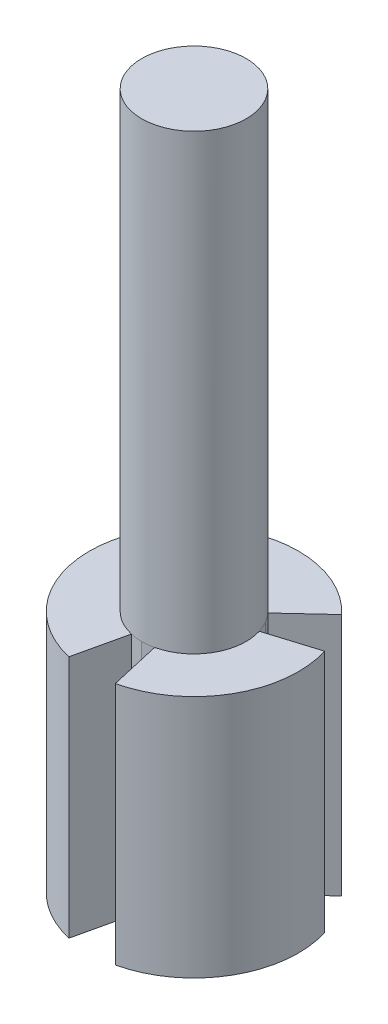
ISO-10303-21;
HEADER;
FILE_DESCRIPTION(('STEP AP214'),'2;1');
FILE_NAME('part.step','',(''),(''),'','','');
FILE_SCHEMA(('AUTOMOTIVE_DESIGN { 1 0 10303 214 1 1 1 1 }'));
ENDSEC;
DATA;
#1=APPLICATION_CONTEXT('core data for automotive mechanical design processes');
#2=APPLICATION_PROTOCOL_DEFINITION('international standard','automotive_design',2000,#1);
#3=PRODUCT_CONTEXT('',#1,'mechanical');
#4=PRODUCT('Part','Part','',(#3));
#5=PRODUCT_RELATED_PRODUCT_CATEGORY('part','',(#4));
#6=PRODUCT_DEFINITION_FORMATION('','',#4);
#7=PRODUCT_DEFINITION_CONTEXT('part definition',#1,'design');
#8=PRODUCT_DEFINITION('design','',#6,#7);
#9=PRODUCT_DEFINITION_SHAPE('','',#8);
#10=(LENGTH_UNIT() NAMED_UNIT(*) SI_UNIT(.MILLI.,.METRE.));
#11=(NAMED_UNIT(*) PLANE_ANGLE_UNIT() SI_UNIT($,.RADIAN.));
#12=(NAMED_UNIT(*) SI_UNIT($,.STERADIAN.) SOLID_ANGLE_UNIT());
#13=UNCERTAINTY_MEASURE_WITH_UNIT(LENGTH_MEASURE(1.E-05),#10,'distance_accuracy_value','');
#14=(GEOMETRIC_REPRESENTATION_CONTEXT(3) GLOBAL_UNCERTAINTY_ASSIGNED_CONTEXT((#13)) GLOBAL_UNIT_ASSIGNED_CONTEXT((#10,
#11,#12)) REPRESENTATION_CONTEXT('',''));
#15=CARTESIAN_POINT('',(0.,0.,0.));
#16=DIRECTION('',(0.,0.,1.));
#17=DIRECTION('',(1.,0.,0.));
#18=AXIS2_PLACEMENT_3D('',#15,#16,#17);
#19=CARTESIAN_POINT('',(0.,70.,0.));
#20=DIRECTION('',(0.,-1.,0.));
#21=DIRECTION('',(0.,0.,-1.));
#22=AXIS2_PLACEMENT_3D('',#19,#20,#21);
#23=CYLINDRICAL_SURFACE('',#22,30.);
#24=DIRECTION('',(0.,-1.,0.));
#25=VECTOR('',#24,1.);
#26=CARTESIAN_POINT('',(21.9974186413753,70.,-20.3988620544401));
#27=LINE('',#26,#25);
#28=CARTESIAN_POINT('',(21.9974186413753,0.,-20.3988620544401));
#29=VERTEX_POINT('',#28);
#30=CARTESIAN_POINT('',(21.9974186413753,70.,-20.3988620544401));
#31=VERTEX_POINT('',#30);
#32=EDGE_CURVE('E229',#29,#31,#27,.F.);
#33=ORIENTED_EDGE('',*,*,#32,.F.);
#34=CARTESIAN_POINT('',(0.,0.,0.));
#35=DIRECTION('',(0.,-1.,0.));
#36=DIRECTION('',(0.,0.,-1.));
#37=AXIS2_PLACEMENT_3D('',#34,#35,#36);
#38=CIRCLE('',#37,30.);
#39=CARTESIAN_POINT('',(-21.997418641375,0.,-20.3988620544404));
#40=VERTEX_POINT('',#39);
#41=EDGE_CURVE('E279',#40,#29,#38,.T.);
#42=ORIENTED_EDGE('',*,*,#41,.F.);
#43=DIRECTION('',(0.,-1.,0.));
#44=VECTOR('',#43,1.);
#45=CARTESIAN_POINT('',(-21.997418641375,70.,-20.3988620544404));
#46=LINE('',#45,#44);
#47=CARTESIAN_POINT('',(-21.997418641375,70.,-20.3988620544404));
#48=VERTEX_POINT('',#47);
#49=EDGE_CURVE('E58',#48,#40,#46,.T.);
#50=ORIENTED_EDGE('',*,*,#49,.F.);
#51=CARTESIAN_POINT('',(0.,70.,0.));
#52=DIRECTION('',(0.,-1.,0.));
#53=DIRECTION('',(0.,0.,-1.));
#54=AXIS2_PLACEMENT_3D('',#51,#52,#53);
#55=CIRCLE('',#54,30.);
#56=EDGE_CURVE('E276',#48,#31,#55,.T.);
#57=ORIENTED_EDGE('',*,*,#56,.T.);
#58=EDGE_LOOP('',(#33,#42,#50,#57));
#59=FACE_BOUND('',#58,.T.);
#60=ADVANCED_FACE('F35',(#59),#23,.T.);
#61=CARTESIAN_POINT('',(0.,70.,0.));
#62=DIRECTION('',(0.,-1.,0.));
#63=DIRECTION('',(0.,0.,-1.));
#64=AXIS2_PLACEMENT_3D('',#61,#62,#63);
#65=PLANE('',#64);
#66=CARTESIAN_POINT('',(0.,70.,0.));
#67=DIRECTION('',(0.,-1.,0.));
#68=DIRECTION('',(0.,0.,-1.));
#69=AXIS2_PLACEMENT_3D('',#66,#67,#68);
#70=CIRCLE('',#69,15.);
#71=CARTESIAN_POINT('',(-10.9987093206875,70.,-10.1994310272202));
#72=VERTEX_POINT('',#71);
#73=CARTESIAN_POINT('',(10.9987093206876,70.,-10.19943102722));
#74=VERTEX_POINT('',#73);
#75=EDGE_CURVE('E208',#72,#74,#70,.T.);
#76=ORIENTED_EDGE('',*,*,#75,.T.);
#77=DIRECTION('',(-0.733247288045842,0.,0.679962068481336));
#78=VECTOR('',#77,1.);
#79=CARTESIAN_POINT('',(10.9987093206876,70.,-10.19943102722));
#80=LINE('',#79,#78);
#81=EDGE_CURVE('E176',#31,#74,#80,.T.);
#82=ORIENTED_EDGE('',*,*,#81,.F.);
#83=ORIENTED_EDGE('',*,*,#56,.F.);
#84=DIRECTION('',(-0.733247288045833,0.,-0.679962068481347));
#85=VECTOR('',#84,1.);
#86=CARTESIAN_POINT('',(-10.9987093206875,70.,-10.1994310272202));
#87=LINE('',#86,#85);
#88=EDGE_CURVE('E234',#72,#48,#87,.T.);
#89=ORIENTED_EDGE('',*,*,#88,.F.);
#90=EDGE_LOOP('',(#76,#82,#83,#89));
#91=FACE_BOUND('',#90,.T.);
#92=ADVANCED_FACE('F308',(#91),#65,.F.);
#93=DIRECTION('',(0.,-1.,0.));
#94=VECTOR('',#93,1.);
#95=CARTESIAN_POINT('',(-28.6646420681272,70.,-8.85089233389217));
#96=LINE('',#95,#94);
#97=CARTESIAN_POINT('',(-28.6646420681272,0.,-8.85089233389217));
#98=VERTEX_POINT('',#97);
#99=CARTESIAN_POINT('',(-28.6646420681272,70.,-8.85089233389218));
#100=VERTEX_POINT('',#99);
#101=EDGE_CURVE('E249',#98,#100,#96,.F.);
#102=ORIENTED_EDGE('',*,*,#101,.F.);
#103=CARTESIAN_POINT('',(-6.66722342675217,0.,29.2497543883323));
#104=VERTEX_POINT('',#103);
#105=EDGE_CURVE('E277',#104,#98,#38,.T.);
#106=ORIENTED_EDGE('',*,*,#105,.F.);
#107=DIRECTION('',(0.,-1.,0.));
#108=VECTOR('',#107,1.);
#109=CARTESIAN_POINT('',(-6.66722342675217,70.,29.2497543883323));
#110=LINE('',#109,#108);
#111=CARTESIAN_POINT('',(-6.66722342675217,70.,29.2497543883323));
#112=VERTEX_POINT('',#111);
#113=EDGE_CURVE('E265',#112,#104,#110,.T.);
#114=ORIENTED_EDGE('',*,*,#113,.F.);
#115=EDGE_CURVE('E183',#112,#100,#55,.T.);
#116=ORIENTED_EDGE('',*,*,#115,.T.);
#117=EDGE_LOOP('',(#102,#106,#114,#116));
#118=FACE_BOUND('',#117,.T.);
#119=ADVANCED_FACE('F302',(#118),#23,.T.);
#120=CARTESIAN_POINT('',(-3.33361171337609,70.,14.6248771941662));
#121=VERTEX_POINT('',#120);
#122=CARTESIAN_POINT('',(-14.3323210340636,70.,-4.42544616694609));
#123=VERTEX_POINT('',#122);
#124=EDGE_CURVE('E193',#121,#123,#70,.T.);
#125=ORIENTED_EDGE('',*,*,#124,.T.);
#126=DIRECTION('',(0.955488068937574,0.,0.295029744463073));
#127=VECTOR('',#126,1.);
#128=CARTESIAN_POINT('',(-14.3323210340636,70.,-4.42544616694609));
#129=LINE('',#128,#127);
#130=EDGE_CURVE('E236',#100,#123,#129,.T.);
#131=ORIENTED_EDGE('',*,*,#130,.F.);
#132=ORIENTED_EDGE('',*,*,#115,.F.);
#133=DIRECTION('',(-0.222240780891739,0.,0.974991812944411));
#134=VECTOR('',#133,1.);
#135=CARTESIAN_POINT('',(-3.33361171337609,70.,14.6248771941662));
#136=LINE('',#135,#134);
#137=EDGE_CURVE('E254',#121,#112,#136,.T.);
#138=ORIENTED_EDGE('',*,*,#137,.F.);
#139=EDGE_LOOP('',(#125,#131,#132,#138));
#140=FACE_BOUND('',#139,.T.);
#141=ADVANCED_FACE('F309',(#140),#65,.F.);
#142=CARTESIAN_POINT('',(0.,200.,0.));
#143=DIRECTION('',(0.,-1.,0.));
#144=DIRECTION('',(0.,0.,-1.));
#145=AXIS2_PLACEMENT_3D('',#142,#143,#144);
#146=CYLINDRICAL_SURFACE('',#145,15.);
#147=CARTESIAN_POINT('',(0.,200.,0.));
#148=DIRECTION('',(0.,1.,0.));
#149=DIRECTION('',(0.,0.,1.));
#150=AXIS2_PLACEMENT_3D('',#147,#148,#149);
#151=CIRCLE('',#150,15.);
#152=CARTESIAN_POINT('',(0.,200.,15.));
#153=VERTEX_POINT('',#152);
#154=EDGE_CURVE('E181',#153,#153,#151,.T.);
#155=ORIENTED_EDGE('',*,*,#154,.F.);
#156=EDGE_LOOP('',(#155));
#157=FACE_BOUND('',#156,.T.);
#158=CARTESIAN_POINT('',(3.33361171337609,70.,14.6248771941662));
#159=VERTEX_POINT('',#158);
#160=CARTESIAN_POINT('',(0.,70.,15.));
#161=VERTEX_POINT('',#160);
#162=EDGE_CURVE('E180',#159,#161,#70,.T.);
#163=ORIENTED_EDGE('',*,*,#162,.F.);
#164=CARTESIAN_POINT('',(14.3323210340637,70.,-4.42544616694589));
#165=VERTEX_POINT('',#164);
#166=EDGE_CURVE('E152',#165,#159,#70,.T.);
#167=ORIENTED_EDGE('',*,*,#166,.F.);
#168=CARTESIAN_POINT('',(12.9903810567666,70.,-7.49999999999988));
#169=VERTEX_POINT('',#168);
#170=EDGE_CURVE('E142',#169,#165,#70,.T.);
#171=ORIENTED_EDGE('',*,*,#170,.F.);
#172=EDGE_CURVE('E151',#74,#169,#70,.T.);
#173=ORIENTED_EDGE('',*,*,#172,.F.);
#174=ORIENTED_EDGE('',*,*,#75,.F.);
#175=CARTESIAN_POINT('',(-12.9903810567665,70.,-7.50000000000006));
#176=VERTEX_POINT('',#175);
#177=EDGE_CURVE('E203',#176,#72,#70,.T.);
#178=ORIENTED_EDGE('',*,*,#177,.F.);
#179=EDGE_CURVE('E198',#123,#176,#70,.T.);
#180=ORIENTED_EDGE('',*,*,#179,.F.);
#181=ORIENTED_EDGE('',*,*,#124,.F.);
#182=EDGE_CURVE('E187',#161,#121,#70,.T.);
#183=ORIENTED_EDGE('',*,*,#182,.F.);
#184=EDGE_LOOP('',(#163,#167,#171,#173,#174,#178,#180,#181,#183));
#185=FACE_BOUND('',#184,.T.);
#186=ADVANCED_FACE('F37',(#157,#185),#146,.T.);
#187=CARTESIAN_POINT('',(0.,200.,0.));
#188=DIRECTION('',(0.,1.,0.));
#189=DIRECTION('',(0.,0.,1.));
#190=AXIS2_PLACEMENT_3D('',#187,#188,#189);
#191=PLANE('',#190);
#192=ORIENTED_EDGE('',*,*,#154,.T.);
#193=EDGE_LOOP('',(#192));
#194=FACE_BOUND('',#193,.T.);
#195=ADVANCED_FACE('F300',(#194),#191,.T.);
#196=DIRECTION('',(0.,-1.,0.));
#197=VECTOR('',#196,1.);
#198=CARTESIAN_POINT('',(28.6646420681273,70.,-8.85089233389178));
#199=LINE('',#198,#197);
#200=CARTESIAN_POINT('',(28.6646420681273,70.,-8.85089233389179));
#201=VERTEX_POINT('',#200);
#202=CARTESIAN_POINT('',(28.6646420681273,0.,-8.85089233389178));
#203=VERTEX_POINT('',#202);
#204=EDGE_CURVE('E50',#201,#203,#199,.T.);
#205=ORIENTED_EDGE('',*,*,#204,.F.);
#206=CARTESIAN_POINT('',(6.66722342675218,70.,29.2497543883323));
#207=VERTEX_POINT('',#206);
#208=EDGE_CURVE('E175',#201,#207,#55,.T.);
#209=ORIENTED_EDGE('',*,*,#208,.T.);
#210=DIRECTION('',(0.,-1.,0.));
#211=VECTOR('',#210,1.);
#212=CARTESIAN_POINT('',(6.66722342675218,70.,29.2497543883323));
#213=LINE('',#212,#211);
#214=CARTESIAN_POINT('',(6.66722342675218,0.,29.2497543883323));
#215=VERTEX_POINT('',#214);
#216=EDGE_CURVE('E270',#215,#207,#213,.F.);
#217=ORIENTED_EDGE('',*,*,#216,.F.);
#218=EDGE_CURVE('E273',#203,#215,#38,.T.);
#219=ORIENTED_EDGE('',*,*,#218,.F.);
#220=EDGE_LOOP('',(#205,#209,#217,#219));
#221=FACE_BOUND('',#220,.T.);
#222=ADVANCED_FACE('F298',(#221),#23,.T.);
#223=ORIENTED_EDGE('',*,*,#208,.F.);
#224=DIRECTION('',(0.955488068937578,0.,-0.295029744463059));
#225=VECTOR('',#224,1.);
#226=CARTESIAN_POINT('',(14.3323210340637,70.,-4.42544616694589));
#227=LINE('',#226,#225);
#228=EDGE_CURVE('E158',#165,#201,#227,.T.);
#229=ORIENTED_EDGE('',*,*,#228,.F.);
#230=ORIENTED_EDGE('',*,*,#166,.T.);
#231=DIRECTION('',(-0.222240780891739,0.,-0.974991812944411));
#232=VECTOR('',#231,1.);
#233=CARTESIAN_POINT('',(3.33361171337609,70.,14.6248771941662));
#234=LINE('',#233,#232);
#235=EDGE_CURVE('E256',#207,#159,#234,.T.);
#236=ORIENTED_EDGE('',*,*,#235,.F.);
#237=EDGE_LOOP('',(#223,#229,#230,#236));
#238=FACE_BOUND('',#237,.T.);
#239=ADVANCED_FACE('F172',(#238),#65,.F.);
#240=CARTESIAN_POINT('',(0.,0.,0.));
#241=DIRECTION('',(0.,1.,0.));
#242=DIRECTION('',(0.,0.,1.));
#243=AXIS2_PLACEMENT_3D('',#240,#241,#242);
#244=PLANE('',#243);
#245=ORIENTED_EDGE('',*,*,#41,.T.);
#246=DIRECTION('',(-0.733247288045842,0.,0.679962068481336));
#247=VECTOR('',#246,1.);
#248=CARTESIAN_POINT('',(0.,0.,0.));
#249=LINE('',#248,#247);
#250=CARTESIAN_POINT('',(10.9987093206876,0.,-10.19943102722));
#251=VERTEX_POINT('',#250);
#252=EDGE_CURVE('E11',#29,#251,#249,.T.);
#253=ORIENTED_EDGE('',*,*,#252,.T.);
#254=DIRECTION('',(0.593704579541423,0.,0.804683088073524));
#255=VECTOR('',#254,1.);
#256=CARTESIAN_POINT('',(11.9945451887271,0.,-8.84971551360997));
#257=LINE('',#256,#255);
#258=CARTESIAN_POINT('',(12.9903810567666,0.,-7.49999999999988));
#259=VERTEX_POINT('',#258);
#260=EDGE_CURVE('E43',#251,#259,#257,.T.);
#261=ORIENTED_EDGE('',*,*,#260,.T.);
#262=DIRECTION('',(0.400023706496655,0.,0.9165047922628));
#263=VECTOR('',#262,1.);
#264=CARTESIAN_POINT('',(13.6613510454152,0.,-5.96272308347289));
#265=LINE('',#264,#263);
#266=CARTESIAN_POINT('',(14.3323210340637,0.,-4.42544616694589));
#267=VERTEX_POINT('',#266);
#268=EDGE_CURVE('E564',#259,#267,#265,.T.);
#269=ORIENTED_EDGE('',*,*,#268,.T.);
#270=DIRECTION('',(0.955488068937578,0.,-0.295029744463059));
#271=VECTOR('',#270,1.);
#272=CARTESIAN_POINT('',(0.,0.,0.));
#273=LINE('',#272,#271);
#274=EDGE_CURVE('E159',#267,#203,#273,.T.);
#275=ORIENTED_EDGE('',*,*,#274,.T.);
#276=ORIENTED_EDGE('',*,*,#218,.T.);
#277=DIRECTION('',(-0.222240780891739,0.,-0.974991812944412));
#278=VECTOR('',#277,1.);
#279=CARTESIAN_POINT('',(0.,0.,0.));
#280=LINE('',#279,#278);
#281=CARTESIAN_POINT('',(3.33361171337609,0.,14.6248771941662));
#282=VERTEX_POINT('',#281);
#283=EDGE_CURVE('E289',#215,#282,#280,.T.);
#284=ORIENTED_EDGE('',*,*,#283,.T.);
#285=DIRECTION('',(-0.993728286038093,0.,0.111821704189278));
#286=VECTOR('',#285,1.);
#287=CARTESIAN_POINT('',(1.66680585668805,0.,14.8124385970831));
#288=LINE('',#287,#286);
#289=CARTESIAN_POINT('',(0.,0.,15.));
#290=VERTEX_POINT('',#289);
#291=EDGE_CURVE('E296',#282,#290,#288,.T.);
#292=ORIENTED_EDGE('',*,*,#291,.T.);
#293=DIRECTION('',(-0.993728286038093,0.,-0.111821704189277));
#294=VECTOR('',#293,1.);
#295=CARTESIAN_POINT('',(-1.66680585668804,0.,14.8124385970831));
#296=LINE('',#295,#294);
#297=CARTESIAN_POINT('',(-3.33361171337609,0.,14.6248771941662));
#298=VERTEX_POINT('',#297);
#299=EDGE_CURVE('E192',#290,#298,#296,.T.);
#300=ORIENTED_EDGE('',*,*,#299,.T.);
#301=DIRECTION('',(-0.222240780891739,0.,0.974991812944411));
#302=VECTOR('',#301,1.);
#303=CARTESIAN_POINT('',(0.,0.,0.));
#304=LINE('',#303,#302);
#305=EDGE_CURVE('E186',#298,#104,#304,.T.);
#306=ORIENTED_EDGE('',*,*,#305,.T.);
#307=ORIENTED_EDGE('',*,*,#105,.T.);
#308=DIRECTION('',(0.955488068937574,0.,0.295029744463073));
#309=VECTOR('',#308,1.);
#310=CARTESIAN_POINT('',(0.,0.,0.));
#311=LINE('',#310,#309);
#312=CARTESIAN_POINT('',(-14.3323210340636,0.,-4.42544616694609));
#313=VERTEX_POINT('',#312);
#314=EDGE_CURVE('E326',#98,#313,#311,.T.);
#315=ORIENTED_EDGE('',*,*,#314,.T.);
#316=DIRECTION('',(0.400023706496667,0.,-0.916504792262795));
#317=VECTOR('',#316,1.);
#318=CARTESIAN_POINT('',(-13.6613510454151,0.,-5.96272308347307));
#319=LINE('',#318,#317);
#320=CARTESIAN_POINT('',(-12.9903810567665,0.,-7.50000000000006));
#321=VERTEX_POINT('',#320);
#322=EDGE_CURVE('E557',#313,#321,#319,.T.);
#323=ORIENTED_EDGE('',*,*,#322,.T.);
#324=DIRECTION('',(0.593704579541433,0.,-0.804683088073516));
#325=VECTOR('',#324,1.);
#326=CARTESIAN_POINT('',(-11.994545188727,0.,-8.84971551361013));
#327=LINE('',#326,#325);
#328=CARTESIAN_POINT('',(-10.9987093206875,0.,-10.1994310272202));
#329=VERTEX_POINT('',#328);
#330=EDGE_CURVE('E554',#321,#329,#327,.T.);
#331=ORIENTED_EDGE('',*,*,#330,.T.);
#332=DIRECTION('',(-0.733247288045833,0.,-0.679962068481346));
#333=VECTOR('',#332,1.);
#334=CARTESIAN_POINT('',(0.,0.,0.));
#335=LINE('',#334,#333);
#336=EDGE_CURVE('E295',#329,#40,#335,.T.);
#337=ORIENTED_EDGE('',*,*,#336,.T.);
#338=EDGE_LOOP('',(#245,#253,#261,#269,#275,#276,#284,#292,#300,#306,#307,#315,#323,#331,#337));
#339=FACE_BOUND('',#338,.T.);
#340=ADVANCED_FACE('F287',(#339),#244,.F.);
#341=CARTESIAN_POINT('',(0.,70.,0.));
#342=DIRECTION('',(0.,-1.,0.));
#343=DIRECTION('',(0.,0.,-1.));
#344=AXIS2_PLACEMENT_3D('',#341,#342,#343);
#345=PLANE('',#344);
#346=ORIENTED_EDGE('',*,*,#162,.T.);
#347=DIRECTION('',(-0.993728286038093,0.,0.111821704189278));
#348=VECTOR('',#347,1.);
#349=CARTESIAN_POINT('',(0.,70.,15.));
#350=LINE('',#349,#348);
#351=EDGE_CURVE('E259',#159,#161,#350,.T.);
#352=ORIENTED_EDGE('',*,*,#351,.F.);
#353=EDGE_LOOP('',(#346,#352));
#354=FACE_BOUND('',#353,.T.);
#355=ADVANCED_FACE('F337',(#354),#345,.T.);
#356=ORIENTED_EDGE('',*,*,#182,.T.);
#357=DIRECTION('',(-0.993728286038093,0.,-0.111821704189277));
#358=VECTOR('',#357,1.);
#359=CARTESIAN_POINT('',(-3.33361171337609,70.,14.6248771941662));
#360=LINE('',#359,#358);
#361=EDGE_CURVE('E251',#161,#121,#360,.T.);
#362=ORIENTED_EDGE('',*,*,#361,.F.);
#363=EDGE_LOOP('',(#356,#362));
#364=FACE_BOUND('',#363,.T.);
#365=ADVANCED_FACE('F334',(#364),#345,.T.);
#366=CARTESIAN_POINT('',(-3.33361171337609,-14.,14.6248771941662));
#367=DIRECTION('',(0.111821704189277,0.,-0.993728286038093));
#368=DIRECTION('',(-0.993728286038093,0.,-0.111821704189277));
#369=AXIS2_PLACEMENT_3D('',#366,#367,#368);
#370=PLANE('',#369);
#371=DIRECTION('',(0.,1.,0.));
#372=VECTOR('',#371,1.);
#373=CARTESIAN_POINT('',(0.,-14.,15.));
#374=LINE('',#373,#372);
#375=EDGE_CURVE('E263',#290,#161,#374,.T.);
#376=ORIENTED_EDGE('',*,*,#375,.T.);
#377=ORIENTED_EDGE('',*,*,#361,.T.);
#378=DIRECTION('',(0.,1.,0.));
#379=VECTOR('',#378,1.);
#380=CARTESIAN_POINT('',(-3.33361171337609,-14.,14.6248771941662));
#381=LINE('',#380,#379);
#382=EDGE_CURVE('E262',#298,#121,#381,.T.);
#383=ORIENTED_EDGE('',*,*,#382,.F.);
#384=ORIENTED_EDGE('',*,*,#299,.F.);
#385=EDGE_LOOP('',(#376,#377,#383,#384));
#386=FACE_BOUND('',#385,.T.);
#387=ADVANCED_FACE('F332',(#386),#370,.F.);
#388=CARTESIAN_POINT('',(0.,-14.,15.));
#389=DIRECTION('',(-0.111821704189278,0.,-0.993728286038093));
#390=DIRECTION('',(-0.993728286038093,0.,0.111821704189278));
#391=AXIS2_PLACEMENT_3D('',#388,#389,#390);
#392=PLANE('',#391);
#393=DIRECTION('',(0.,1.,0.));
#394=VECTOR('',#393,1.);
#395=CARTESIAN_POINT('',(3.33361171337609,-14.,14.6248771941662));
#396=LINE('',#395,#394);
#397=EDGE_CURVE('E266',#282,#159,#396,.T.);
#398=ORIENTED_EDGE('',*,*,#397,.T.);
#399=ORIENTED_EDGE('',*,*,#351,.T.);
#400=ORIENTED_EDGE('',*,*,#375,.F.);
#401=ORIENTED_EDGE('',*,*,#291,.F.);
#402=EDGE_LOOP('',(#398,#399,#400,#401));
#403=FACE_BOUND('',#402,.T.);
#404=ADVANCED_FACE('F336',(#403),#392,.F.);
#405=CARTESIAN_POINT('',(3.33361171337609,-14.,14.6248771941662));
#406=DIRECTION('',(0.974991812944411,0.,-0.222240780891739));
#407=DIRECTION('',(-0.222240780891739,0.,-0.974991812944412));
#408=AXIS2_PLACEMENT_3D('',#405,#406,#407);
#409=PLANE('',#408);
#410=ORIENTED_EDGE('',*,*,#216,.T.);
#411=ORIENTED_EDGE('',*,*,#235,.T.);
#412=ORIENTED_EDGE('',*,*,#397,.F.);
#413=ORIENTED_EDGE('',*,*,#283,.F.);
#414=EDGE_LOOP('',(#410,#411,#412,#413));
#415=FACE_BOUND('',#414,.T.);
#416=ADVANCED_FACE('F294',(#415),#409,.F.);
#417=CARTESIAN_POINT('',(-3.33361171337609,-14.,14.6248771941662));
#418=DIRECTION('',(-0.974991812944411,0.,-0.222240780891739));
#419=DIRECTION('',(-0.222240780891739,0.,0.974991812944411));
#420=AXIS2_PLACEMENT_3D('',#417,#418,#419);
#421=PLANE('',#420);
#422=ORIENTED_EDGE('',*,*,#113,.T.);
#423=ORIENTED_EDGE('',*,*,#305,.F.);
#424=ORIENTED_EDGE('',*,*,#382,.T.);
#425=ORIENTED_EDGE('',*,*,#137,.T.);
#426=EDGE_LOOP('',(#422,#423,#424,#425));
#427=FACE_BOUND('',#426,.T.);
#428=ADVANCED_FACE('F328',(#427),#421,.F.);
#429=CARTESIAN_POINT('',(0.,70.,0.));
#430=DIRECTION('',(0.,-1.,0.));
#431=DIRECTION('',(0.866025403784436,0.,0.500000000000004));
#432=AXIS2_PLACEMENT_3D('',#429,#430,#431);
#433=PLANE('',#432);
#434=ORIENTED_EDGE('',*,*,#179,.T.);
#435=DIRECTION('',(0.400023706496667,0.,-0.916504792262795));
#436=VECTOR('',#435,1.);
#437=CARTESIAN_POINT('',(-12.9903810567665,70.,-7.50000000000006));
#438=LINE('',#437,#436);
#439=EDGE_CURVE('E239',#123,#176,#438,.T.);
#440=ORIENTED_EDGE('',*,*,#439,.F.);
#441=EDGE_LOOP('',(#434,#440));
#442=FACE_BOUND('',#441,.T.);
#443=ADVANCED_FACE('F354',(#442),#433,.T.);
#444=ORIENTED_EDGE('',*,*,#177,.T.);
#445=DIRECTION('',(0.593704579541433,0.,-0.804683088073516));
#446=VECTOR('',#445,1.);
#447=CARTESIAN_POINT('',(-10.9987093206875,70.,-10.1994310272202));
#448=LINE('',#447,#446);
#449=EDGE_CURVE('E231',#176,#72,#448,.T.);
#450=ORIENTED_EDGE('',*,*,#449,.F.);
#451=EDGE_LOOP('',(#444,#450));
#452=FACE_BOUND('',#451,.T.);
#453=ADVANCED_FACE('F379',(#452),#433,.T.);
#454=CARTESIAN_POINT('',(-10.9987093206875,-14.,-10.1994310272202));
#455=DIRECTION('',(0.804683088073516,0.,0.593704579541433));
#456=DIRECTION('',(0.593704579541433,0.,-0.804683088073516));
#457=AXIS2_PLACEMENT_3D('',#454,#455,#456);
#458=PLANE('',#457);
#459=DIRECTION('',(0.,1.,0.));
#460=VECTOR('',#459,1.);
#461=CARTESIAN_POINT('',(-12.9903810567665,-14.,-7.50000000000006));
#462=LINE('',#461,#460);
#463=EDGE_CURVE('E243',#321,#176,#462,.T.);
#464=ORIENTED_EDGE('',*,*,#463,.T.);
#465=ORIENTED_EDGE('',*,*,#449,.T.);
#466=DIRECTION('',(0.,1.,0.));
#467=VECTOR('',#466,1.);
#468=CARTESIAN_POINT('',(-10.9987093206875,-14.,-10.1994310272202));
#469=LINE('',#468,#467);
#470=EDGE_CURVE('E242',#329,#72,#469,.T.);
#471=ORIENTED_EDGE('',*,*,#470,.F.);
#472=ORIENTED_EDGE('',*,*,#330,.F.);
#473=EDGE_LOOP('',(#464,#465,#471,#472));
#474=FACE_BOUND('',#473,.T.);
#475=ADVANCED_FACE('F346',(#474),#458,.F.);
#476=CARTESIAN_POINT('',(-12.9903810567665,-14.,-7.50000000000006));
#477=DIRECTION('',(0.916504792262795,0.,0.400023706496667));
#478=DIRECTION('',(0.400023706496667,0.,-0.916504792262795));
#479=AXIS2_PLACEMENT_3D('',#476,#477,#478);
#480=PLANE('',#479);
#481=DIRECTION('',(0.,1.,0.));
#482=VECTOR('',#481,1.);
#483=CARTESIAN_POINT('',(-14.3323210340636,-14.,-4.42544616694609));
#484=LINE('',#483,#482);
#485=EDGE_CURVE('E245',#313,#123,#484,.T.);
#486=ORIENTED_EDGE('',*,*,#485,.T.);
#487=ORIENTED_EDGE('',*,*,#439,.T.);
#488=ORIENTED_EDGE('',*,*,#463,.F.);
#489=ORIENTED_EDGE('',*,*,#322,.F.);
#490=EDGE_LOOP('',(#486,#487,#488,#489));
#491=FACE_BOUND('',#490,.T.);
#492=ADVANCED_FACE('F392',(#491),#480,.F.);
#493=CARTESIAN_POINT('',(-14.3323210340636,-14.,-4.42544616694609));
#494=DIRECTION('',(-0.295029744463072,0.,0.955488068937574));
#495=DIRECTION('',(0.955488068937574,0.,0.295029744463073));
#496=AXIS2_PLACEMENT_3D('',#493,#494,#495);
#497=PLANE('',#496);
#498=ORIENTED_EDGE('',*,*,#101,.T.);
#499=ORIENTED_EDGE('',*,*,#130,.T.);
#500=ORIENTED_EDGE('',*,*,#485,.F.);
#501=ORIENTED_EDGE('',*,*,#314,.F.);
#502=EDGE_LOOP('',(#498,#499,#500,#501));
#503=FACE_BOUND('',#502,.T.);
#504=ADVANCED_FACE('F324',(#503),#497,.F.);
#505=CARTESIAN_POINT('',(-10.9987093206875,-14.,-10.1994310272202));
#506=DIRECTION('',(0.679962068481346,0.,-0.733247288045833));
#507=DIRECTION('',(-0.733247288045833,0.,-0.679962068481346));
#508=AXIS2_PLACEMENT_3D('',#505,#506,#507);
#509=PLANE('',#508);
#510=ORIENTED_EDGE('',*,*,#49,.T.);
#511=ORIENTED_EDGE('',*,*,#336,.F.);
#512=ORIENTED_EDGE('',*,*,#470,.T.);
#513=ORIENTED_EDGE('',*,*,#88,.T.);
#514=EDGE_LOOP('',(#510,#511,#512,#513));
#515=FACE_BOUND('',#514,.T.);
#516=ADVANCED_FACE('F406',(#515),#509,.F.);
#517=CARTESIAN_POINT('',(0.,70.,0.));
#518=DIRECTION('',(0.,-1.,0.));
#519=DIRECTION('',(-0.866025403784443,0.,0.499999999999992));
#520=AXIS2_PLACEMENT_3D('',#517,#518,#519);
#521=PLANE('',#520);
#522=ORIENTED_EDGE('',*,*,#172,.T.);
#523=DIRECTION('',(0.593704579541423,0.,0.804683088073524));
#524=VECTOR('',#523,1.);
#525=CARTESIAN_POINT('',(12.9903810567666,70.,-7.49999999999988));
#526=LINE('',#525,#524);
#527=EDGE_CURVE('E163',#74,#169,#526,.T.);
#528=ORIENTED_EDGE('',*,*,#527,.F.);
#529=EDGE_LOOP('',(#522,#528));
#530=FACE_BOUND('',#529,.T.);
#531=ADVANCED_FACE('F220',(#530),#521,.T.);
#532=ORIENTED_EDGE('',*,*,#170,.T.);
#533=DIRECTION('',(0.400023706496655,0.,0.9165047922628));
#534=VECTOR('',#533,1.);
#535=CARTESIAN_POINT('',(14.3323210340637,70.,-4.42544616694589));
#536=LINE('',#535,#534);
#537=EDGE_CURVE('E146',#169,#165,#536,.T.);
#538=ORIENTED_EDGE('',*,*,#537,.F.);
#539=EDGE_LOOP('',(#532,#538));
#540=FACE_BOUND('',#539,.T.);
#541=ADVANCED_FACE('F144',(#540),#521,.T.);
#542=CARTESIAN_POINT('',(14.3323210340637,-14.,-4.42544616694589));
#543=DIRECTION('',(-0.9165047922628,0.,0.400023706496655));
#544=DIRECTION('',(0.400023706496655,0.,0.9165047922628));
#545=AXIS2_PLACEMENT_3D('',#542,#543,#544);
#546=PLANE('',#545);
#547=DIRECTION('',(0.,1.,0.));
#548=VECTOR('',#547,1.);
#549=CARTESIAN_POINT('',(12.9903810567666,-14.,-7.49999999999988));
#550=LINE('',#549,#548);
#551=EDGE_CURVE('E168',#259,#169,#550,.T.);
#552=ORIENTED_EDGE('',*,*,#551,.T.);
#553=ORIENTED_EDGE('',*,*,#537,.T.);
#554=DIRECTION('',(0.,1.,0.));
#555=VECTOR('',#554,1.);
#556=CARTESIAN_POINT('',(14.3323210340637,-14.,-4.42544616694589));
#557=LINE('',#556,#555);
#558=EDGE_CURVE('E155',#267,#165,#557,.T.);
#559=ORIENTED_EDGE('',*,*,#558,.F.);
#560=ORIENTED_EDGE('',*,*,#268,.F.);
#561=EDGE_LOOP('',(#552,#553,#559,#560));
#562=FACE_BOUND('',#561,.T.);
#563=ADVANCED_FACE('F166',(#562),#546,.F.);
#564=CARTESIAN_POINT('',(12.9903810567666,-14.,-7.49999999999988));
#565=DIRECTION('',(-0.804683088073524,0.,0.593704579541423));
#566=DIRECTION('',(0.593704579541423,0.,0.804683088073524));
#567=AXIS2_PLACEMENT_3D('',#564,#565,#566);
#568=PLANE('',#567);
#569=DIRECTION('',(0.,1.,0.));
#570=VECTOR('',#569,1.);
#571=CARTESIAN_POINT('',(10.9987093206876,-14.,-10.19943102722));
#572=LINE('',#571,#570);
#573=EDGE_CURVE('E162',#251,#74,#572,.T.);
#574=ORIENTED_EDGE('',*,*,#573,.T.);
#575=ORIENTED_EDGE('',*,*,#527,.T.);
#576=ORIENTED_EDGE('',*,*,#551,.F.);
#577=ORIENTED_EDGE('',*,*,#260,.F.);
#578=EDGE_LOOP('',(#574,#575,#576,#577));
#579=FACE_BOUND('',#578,.T.);
#580=ADVANCED_FACE('F429',(#579),#568,.F.);
#581=CARTESIAN_POINT('',(10.9987093206876,-14.,-10.19943102722));
#582=DIRECTION('',(-0.679962068481336,0.,-0.733247288045842));
#583=DIRECTION('',(-0.733247288045842,0.,0.679962068481336));
#584=AXIS2_PLACEMENT_3D('',#581,#582,#583);
#585=PLANE('',#584);
#586=ORIENTED_EDGE('',*,*,#32,.T.);
#587=ORIENTED_EDGE('',*,*,#81,.T.);
#588=ORIENTED_EDGE('',*,*,#573,.F.);
#589=ORIENTED_EDGE('',*,*,#252,.F.);
#590=EDGE_LOOP('',(#586,#587,#588,#589));
#591=FACE_BOUND('',#590,.T.);
#592=ADVANCED_FACE('F436',(#591),#585,.F.);
#593=CARTESIAN_POINT('',(14.3323210340637,-14.,-4.42544616694589));
#594=DIRECTION('',(0.295029744463059,0.,0.955488068937578));
#595=DIRECTION('',(0.955488068937578,0.,-0.295029744463059));
#596=AXIS2_PLACEMENT_3D('',#593,#594,#595);
#597=PLANE('',#596);
#598=ORIENTED_EDGE('',*,*,#204,.T.);
#599=ORIENTED_EDGE('',*,*,#274,.F.);
#600=ORIENTED_EDGE('',*,*,#558,.T.);
#601=ORIENTED_EDGE('',*,*,#228,.T.);
#602=EDGE_LOOP('',(#598,#599,#600,#601));
#603=FACE_BOUND('',#602,.T.);
#604=ADVANCED_FACE('F156',(#603),#597,.F.);
#605=CLOSED_SHELL('',(#60,#92,#119,#141,#186,#195,#222,#239,#340,#355,#365,#387,#404,#416,#428,
#443,#453,#475,#492,#504,#516,#531,#541,#563,#580,#592,#604));
#606=MANIFOLD_SOLID_BREP('B2',#605);
#607=ADVANCED_BREP_SHAPE_REPRESENTATION('',(#18,#606),#14);
#608=SHAPE_DEFINITION_REPRESENTATION(#9,#607);
ENDSEC;
END-ISO-10303-21;
